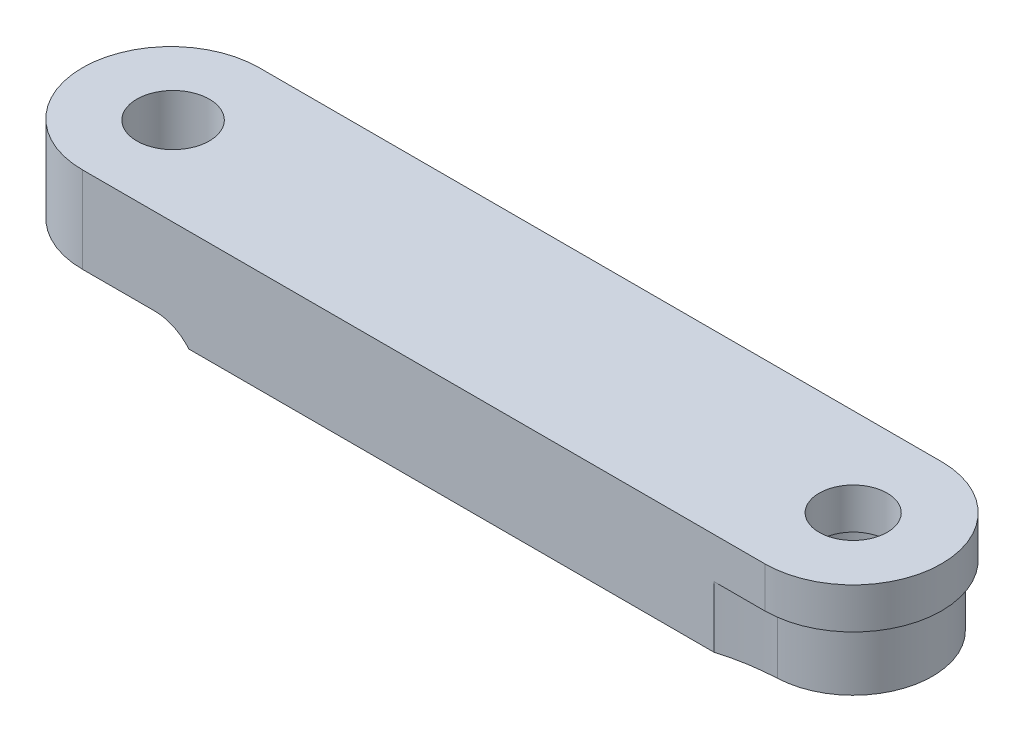
ISO-10303-21;
HEADER;
FILE_DESCRIPTION(('STEP AP214'),'2;1');
FILE_NAME('part.step','',(''),(''),'','','');
FILE_SCHEMA(('AUTOMOTIVE_DESIGN { 1 0 10303 214 1 1 1 1 }'));
ENDSEC;
DATA;
#1=APPLICATION_CONTEXT('core data for automotive mechanical design processes');
#2=APPLICATION_PROTOCOL_DEFINITION('international standard','automotive_design',2000,#1);
#3=PRODUCT_CONTEXT('',#1,'mechanical');
#4=PRODUCT('Part','Part','',(#3));
#5=PRODUCT_RELATED_PRODUCT_CATEGORY('part','',(#4));
#6=PRODUCT_DEFINITION_FORMATION('','',#4);
#7=PRODUCT_DEFINITION_CONTEXT('part definition',#1,'design');
#8=PRODUCT_DEFINITION('design','',#6,#7);
#9=PRODUCT_DEFINITION_SHAPE('','',#8);
#10=(LENGTH_UNIT() NAMED_UNIT(*) SI_UNIT(.MILLI.,.METRE.));
#11=(NAMED_UNIT(*) PLANE_ANGLE_UNIT() SI_UNIT($,.RADIAN.));
#12=(NAMED_UNIT(*) SI_UNIT($,.STERADIAN.) SOLID_ANGLE_UNIT());
#13=UNCERTAINTY_MEASURE_WITH_UNIT(LENGTH_MEASURE(1.E-05),#10,'distance_accuracy_value','');
#14=(GEOMETRIC_REPRESENTATION_CONTEXT(3) GLOBAL_UNCERTAINTY_ASSIGNED_CONTEXT((#13)) GLOBAL_UNIT_ASSIGNED_CONTEXT((#10,
#11,#12)) REPRESENTATION_CONTEXT('',''));
#15=CARTESIAN_POINT('',(0.,0.,0.));
#16=DIRECTION('',(0.,0.,1.));
#17=DIRECTION('',(1.,0.,0.));
#18=AXIS2_PLACEMENT_3D('',#15,#16,#17);
#19=CARTESIAN_POINT('',(0.,0.7,3.9));
#20=DIRECTION('',(0.,1.,0.));
#21=DIRECTION('',(0.,0.,1.));
#22=AXIS2_PLACEMENT_3D('',#19,#20,#21);
#23=PLANE('',#22);
#24=CARTESIAN_POINT('',(-30.,0.7,0.));
#25=DIRECTION('',(0.,1.,0.));
#26=DIRECTION('',(0.,0.,1.));
#27=AXIS2_PLACEMENT_3D('',#24,#25,#26);
#28=CIRCLE('',#27,1.6);
#29=CARTESIAN_POINT('',(-30.,0.7,1.6));
#30=VERTEX_POINT('',#29);
#31=EDGE_CURVE('E168',#30,#30,#28,.T.);
#32=ORIENTED_EDGE('',*,*,#31,.T.);
#33=EDGE_LOOP('',(#32));
#34=FACE_BOUND('',#33,.T.);
#35=DIRECTION('',(1.,0.,0.));
#36=VECTOR('',#35,1.);
#37=CARTESIAN_POINT('',(0.,0.7,-3.9));
#38=LINE('',#37,#36);
#39=CARTESIAN_POINT('',(-30.1,0.7,-3.9));
#40=VERTEX_POINT('',#39);
#41=CARTESIAN_POINT('',(-26.9198684153571,0.7,-3.9));
#42=VERTEX_POINT('',#41);
#43=EDGE_CURVE('E166',#40,#42,#38,.T.);
#44=ORIENTED_EDGE('',*,*,#43,.T.);
#45=DIRECTION('',(0.,0.,-1.));
#46=VECTOR('',#45,1.);
#47=CARTESIAN_POINT('',(-26.9198684153571,0.7,3.9));
#48=LINE('',#47,#46);
#49=CARTESIAN_POINT('',(-26.9198684153571,0.7,3.9));
#50=VERTEX_POINT('',#49);
#51=EDGE_CURVE('E79',#42,#50,#48,.F.);
#52=ORIENTED_EDGE('',*,*,#51,.T.);
#53=DIRECTION('',(1.,0.,0.));
#54=VECTOR('',#53,1.);
#55=CARTESIAN_POINT('',(0.,0.7,3.9));
#56=LINE('',#55,#54);
#57=CARTESIAN_POINT('',(-30.1,0.7,3.9));
#58=VERTEX_POINT('',#57);
#59=EDGE_CURVE('E138',#58,#50,#56,.T.);
#60=ORIENTED_EDGE('',*,*,#59,.F.);
#61=CARTESIAN_POINT('',(-30.1,0.7,0.));
#62=DIRECTION('',(0.,1.,0.));
#63=DIRECTION('',(0.,0.,1.));
#64=AXIS2_PLACEMENT_3D('',#61,#62,#63);
#65=CIRCLE('',#64,3.9);
#66=EDGE_CURVE('E148',#58,#40,#65,.F.);
#67=ORIENTED_EDGE('',*,*,#66,.T.);
#68=EDGE_LOOP('',(#44,#52,#60,#67));
#69=FACE_BOUND('',#68,.T.);
#70=ADVANCED_FACE('F58',(#34,#69),#23,.F.);
#71=CARTESIAN_POINT('',(0.,4.5,3.90000000000001));
#72=DIRECTION('',(0.,0.,-1.));
#73=DIRECTION('',(-1.,0.,0.));
#74=AXIS2_PLACEMENT_3D('',#71,#72,#73);
#75=PLANE('',#74);
#76=DIRECTION('',(0.,-1.,0.));
#77=VECTOR('',#76,1.);
#78=CARTESIAN_POINT('',(-30.1,4.5,3.9));
#79=LINE('',#78,#77);
#80=CARTESIAN_POINT('',(-30.1,4.5,3.9));
#81=VERTEX_POINT('',#80);
#82=EDGE_CURVE('E135',#81,#58,#79,.T.);
#83=ORIENTED_EDGE('',*,*,#82,.T.);
#84=ORIENTED_EDGE('',*,*,#59,.T.);
#85=CARTESIAN_POINT('',(-26.9198684153571,-1.3,3.9));
#86=DIRECTION('',(0.,0.,-1.));
#87=DIRECTION('',(-1.,0.,0.));
#88=AXIS2_PLACEMENT_3D('',#85,#86,#87);
#89=CIRCLE('',#88,2.);
#90=CARTESIAN_POINT('',(-25.4,0.,3.9));
#91=VERTEX_POINT('',#90);
#92=EDGE_CURVE('E12',#50,#91,#89,.T.);
#93=ORIENTED_EDGE('',*,*,#92,.T.);
#94=DIRECTION('',(-1.,0.,0.));
#95=VECTOR('',#94,1.);
#96=CARTESIAN_POINT('',(0.,0.,3.9));
#97=LINE('',#96,#95);
#98=CARTESIAN_POINT('',(-2.25,0.,3.9));
#99=VERTEX_POINT('',#98);
#100=EDGE_CURVE('E153',#99,#91,#97,.T.);
#101=ORIENTED_EDGE('',*,*,#100,.F.);
#102=DIRECTION('',(0.,1.,0.));
#103=VECTOR('',#102,1.);
#104=CARTESIAN_POINT('',(-2.25,0.,3.9));
#105=LINE('',#104,#103);
#106=CARTESIAN_POINT('',(-2.25,2.7,3.90000000000001));
#107=VERTEX_POINT('',#106);
#108=EDGE_CURVE('E157',#99,#107,#105,.T.);
#109=ORIENTED_EDGE('',*,*,#108,.T.);
#110=DIRECTION('',(1.,0.,0.));
#111=VECTOR('',#110,1.);
#112=CARTESIAN_POINT('',(0.,2.7,3.90000000000001));
#113=LINE('',#112,#111);
#114=CARTESIAN_POINT('',(0.,2.7,3.90000000000001));
#115=VERTEX_POINT('',#114);
#116=EDGE_CURVE('E186',#107,#115,#113,.T.);
#117=ORIENTED_EDGE('',*,*,#116,.T.);
#118=DIRECTION('',(0.,-1.,0.));
#119=VECTOR('',#118,1.);
#120=CARTESIAN_POINT('',(0.,4.5,3.90000000000001));
#121=LINE('',#120,#119);
#122=CARTESIAN_POINT('',(0.,4.5,3.90000000000001));
#123=VERTEX_POINT('',#122);
#124=EDGE_CURVE('E145',#123,#115,#121,.T.);
#125=ORIENTED_EDGE('',*,*,#124,.F.);
#126=DIRECTION('',(1.,0.,0.));
#127=VECTOR('',#126,1.);
#128=CARTESIAN_POINT('',(0.,4.5,3.90000000000001));
#129=LINE('',#128,#127);
#130=EDGE_CURVE('E141',#81,#123,#129,.T.);
#131=ORIENTED_EDGE('',*,*,#130,.F.);
#132=EDGE_LOOP('',(#83,#84,#93,#101,#109,#117,#125,#131));
#133=FACE_BOUND('',#132,.T.);
#134=ADVANCED_FACE('F137',(#133),#75,.F.);
#135=CARTESIAN_POINT('',(0.,4.5,-3.9));
#136=DIRECTION('',(0.,0.,1.));
#137=DIRECTION('',(1.,0.,0.));
#138=AXIS2_PLACEMENT_3D('',#135,#136,#137);
#139=PLANE('',#138);
#140=ORIENTED_EDGE('',*,*,#43,.F.);
#141=DIRECTION('',(0.,-1.,0.));
#142=VECTOR('',#141,1.);
#143=CARTESIAN_POINT('',(-30.1,4.5,-3.9));
#144=LINE('',#143,#142);
#145=CARTESIAN_POINT('',(-30.1,4.5,-3.9));
#146=VERTEX_POINT('',#145);
#147=EDGE_CURVE('E144',#146,#40,#144,.T.);
#148=ORIENTED_EDGE('',*,*,#147,.F.);
#149=DIRECTION('',(-1.,0.,0.));
#150=VECTOR('',#149,1.);
#151=CARTESIAN_POINT('',(0.,4.5,-3.9));
#152=LINE('',#151,#150);
#153=CARTESIAN_POINT('',(0.,4.5,-3.9));
#154=VERTEX_POINT('',#153);
#155=EDGE_CURVE('E185',#154,#146,#152,.T.);
#156=ORIENTED_EDGE('',*,*,#155,.F.);
#157=DIRECTION('',(0.,-1.,0.));
#158=VECTOR('',#157,1.);
#159=CARTESIAN_POINT('',(0.,4.5,-3.9));
#160=LINE('',#159,#158);
#161=CARTESIAN_POINT('',(0.,2.7,-3.9));
#162=VERTEX_POINT('',#161);
#163=EDGE_CURVE('E200',#154,#162,#160,.T.);
#164=ORIENTED_EDGE('',*,*,#163,.T.);
#165=DIRECTION('',(-1.,0.,0.));
#166=VECTOR('',#165,1.);
#167=CARTESIAN_POINT('',(0.,2.7,-3.9));
#168=LINE('',#167,#166);
#169=CARTESIAN_POINT('',(-2.25,2.7,-3.9));
#170=VERTEX_POINT('',#169);
#171=EDGE_CURVE('E193',#162,#170,#168,.T.);
#172=ORIENTED_EDGE('',*,*,#171,.T.);
#173=DIRECTION('',(0.,1.,0.));
#174=VECTOR('',#173,1.);
#175=CARTESIAN_POINT('',(-2.25,0.,-3.9));
#176=LINE('',#175,#174);
#177=CARTESIAN_POINT('',(-2.25,0.,-3.9));
#178=VERTEX_POINT('',#177);
#179=EDGE_CURVE('E154',#178,#170,#176,.T.);
#180=ORIENTED_EDGE('',*,*,#179,.F.);
#181=DIRECTION('',(-1.,0.,0.));
#182=VECTOR('',#181,1.);
#183=CARTESIAN_POINT('',(0.,0.,-3.9));
#184=LINE('',#183,#182);
#185=CARTESIAN_POINT('',(-25.4,0.,-3.9));
#186=VERTEX_POINT('',#185);
#187=EDGE_CURVE('E160',#178,#186,#184,.T.);
#188=ORIENTED_EDGE('',*,*,#187,.T.);
#189=CARTESIAN_POINT('',(-26.9198684153571,-1.3,-3.9));
#190=DIRECTION('',(0.,0.,1.));
#191=DIRECTION('',(1.,0.,0.));
#192=AXIS2_PLACEMENT_3D('',#189,#190,#191);
#193=CIRCLE('',#192,2.);
#194=EDGE_CURVE('E66',#186,#42,#193,.T.);
#195=ORIENTED_EDGE('',*,*,#194,.T.);
#196=EDGE_LOOP('',(#140,#148,#156,#164,#172,#180,#188,#195));
#197=FACE_BOUND('',#196,.T.);
#198=ADVANCED_FACE('F251',(#197),#139,.F.);
#199=CARTESIAN_POINT('',(0.,2.7,0.));
#200=DIRECTION('',(0.,-1.,0.));
#201=DIRECTION('',(0.,0.,-1.));
#202=AXIS2_PLACEMENT_3D('',#199,#200,#201);
#203=CYLINDRICAL_SURFACE('',#202,3.5);
#204=CARTESIAN_POINT('',(0.,2.7,0.));
#205=DIRECTION('',(0.,1.,0.));
#206=DIRECTION('',(0.,0.,1.));
#207=AXIS2_PLACEMENT_3D('',#204,#205,#206);
#208=CIRCLE('',#207,3.5);
#209=CARTESIAN_POINT('',(0.154134895235334,2.7,3.49660441486749));
#210=VERTEX_POINT('',#209);
#211=CARTESIAN_POINT('',(0.154134895235327,2.7,-3.49660441486749));
#212=VERTEX_POINT('',#211);
#213=EDGE_CURVE('E210',#210,#212,#208,.T.);
#214=ORIENTED_EDGE('',*,*,#213,.F.);
#215=DIRECTION('',(0.,-1.,0.));
#216=VECTOR('',#215,1.);
#217=CARTESIAN_POINT('',(0.154134895235334,2.7,3.49660441486749));
#218=LINE('',#217,#216);
#219=CARTESIAN_POINT('',(0.154134895235334,0.,3.49660441486749));
#220=VERTEX_POINT('',#219);
#221=EDGE_CURVE('E221',#210,#220,#218,.T.);
#222=ORIENTED_EDGE('',*,*,#221,.T.);
#223=CARTESIAN_POINT('',(0.,0.,0.));
#224=DIRECTION('',(0.,1.,0.));
#225=DIRECTION('',(0.,0.,1.));
#226=AXIS2_PLACEMENT_3D('',#223,#224,#225);
#227=CIRCLE('',#226,3.5);
#228=CARTESIAN_POINT('',(0.154134895235327,0.,-3.49660441486749));
#229=VERTEX_POINT('',#228);
#230=EDGE_CURVE('E209',#220,#229,#227,.T.);
#231=ORIENTED_EDGE('',*,*,#230,.T.);
#232=DIRECTION('',(0.,-1.,0.));
#233=VECTOR('',#232,1.);
#234=CARTESIAN_POINT('',(0.154134895235327,2.7,-3.49660441486749));
#235=LINE('',#234,#233);
#236=EDGE_CURVE('E219',#229,#212,#235,.F.);
#237=ORIENTED_EDGE('',*,*,#236,.T.);
#238=EDGE_LOOP('',(#214,#222,#231,#237));
#239=FACE_BOUND('',#238,.T.);
#240=ADVANCED_FACE('F256',(#239),#203,.T.);
#241=CARTESIAN_POINT('',(0.,2.7,0.));
#242=DIRECTION('',(0.,-1.,0.));
#243=DIRECTION('',(0.,0.,-1.));
#244=AXIS2_PLACEMENT_3D('',#241,#242,#243);
#245=PLANE('',#244);
#246=ORIENTED_EDGE('',*,*,#116,.F.);
#247=CARTESIAN_POINT('',(0.59452031019343,2.7,13.4869027430603));
#248=DIRECTION('',(0.,-1.,0.));
#249=DIRECTION('',(0.,0.,-1.));
#250=AXIS2_PLACEMENT_3D('',#247,#248,#249);
#251=CIRCLE('',#250,10.);
#252=EDGE_CURVE('E217',#107,#210,#251,.T.);
#253=ORIENTED_EDGE('',*,*,#252,.T.);
#254=ORIENTED_EDGE('',*,*,#213,.T.);
#255=CARTESIAN_POINT('',(0.594520310193404,2.7,-13.4869027430603));
#256=DIRECTION('',(0.,-1.,0.));
#257=DIRECTION('',(0.,0.,-1.));
#258=AXIS2_PLACEMENT_3D('',#255,#256,#257);
#259=CIRCLE('',#258,10.);
#260=EDGE_CURVE('E213',#212,#170,#259,.T.);
#261=ORIENTED_EDGE('',*,*,#260,.T.);
#262=ORIENTED_EDGE('',*,*,#171,.F.);
#263=CARTESIAN_POINT('',(0.,2.7,0.));
#264=DIRECTION('',(0.,1.,0.));
#265=DIRECTION('',(0.,0.,-1.));
#266=AXIS2_PLACEMENT_3D('',#263,#264,#265);
#267=CIRCLE('',#266,3.9);
#268=EDGE_CURVE('E181',#115,#162,#267,.T.);
#269=ORIENTED_EDGE('',*,*,#268,.F.);
#270=EDGE_LOOP('',(#246,#253,#254,#261,#262,#269));
#271=FACE_BOUND('',#270,.T.);
#272=ADVANCED_FACE('F259',(#271),#245,.T.);
#273=CARTESIAN_POINT('',(0.,0.,0.));
#274=DIRECTION('',(0.,1.,0.));
#275=DIRECTION('',(0.,0.,1.));
#276=AXIS2_PLACEMENT_3D('',#273,#274,#275);
#277=PLANE('',#276);
#278=CARTESIAN_POINT('',(0.,0.,0.));
#279=DIRECTION('',(0.,1.,0.));
#280=DIRECTION('',(0.,0.,1.));
#281=AXIS2_PLACEMENT_3D('',#278,#279,#280);
#282=CIRCLE('',#281,2.25);
#283=CARTESIAN_POINT('',(0.,0.,-2.25));
#284=VERTEX_POINT('',#283);
#285=EDGE_CURVE('E206',#284,#284,#282,.T.);
#286=ORIENTED_EDGE('',*,*,#285,.T.);
#287=EDGE_LOOP('',(#286));
#288=FACE_BOUND('',#287,.T.);
#289=ORIENTED_EDGE('',*,*,#187,.F.);
#290=CARTESIAN_POINT('',(0.594520310193404,0.,-13.4869027430603));
#291=DIRECTION('',(0.,1.,0.));
#292=DIRECTION('',(0.,0.,1.));
#293=AXIS2_PLACEMENT_3D('',#290,#291,#292);
#294=CIRCLE('',#293,10.);
#295=EDGE_CURVE('E151',#178,#229,#294,.T.);
#296=ORIENTED_EDGE('',*,*,#295,.T.);
#297=ORIENTED_EDGE('',*,*,#230,.F.);
#298=CARTESIAN_POINT('',(0.59452031019343,0.,13.4869027430603));
#299=DIRECTION('',(0.,1.,0.));
#300=DIRECTION('',(0.,0.,1.));
#301=AXIS2_PLACEMENT_3D('',#298,#299,#300);
#302=CIRCLE('',#301,10.);
#303=EDGE_CURVE('E223',#220,#99,#302,.T.);
#304=ORIENTED_EDGE('',*,*,#303,.T.);
#305=ORIENTED_EDGE('',*,*,#100,.T.);
#306=DIRECTION('',(0.,0.,-1.));
#307=VECTOR('',#306,1.);
#308=CARTESIAN_POINT('',(-25.4,0.,3.9));
#309=LINE('',#308,#307);
#310=EDGE_CURVE('E165',#91,#186,#309,.T.);
#311=ORIENTED_EDGE('',*,*,#310,.T.);
#312=EDGE_LOOP('',(#289,#296,#297,#304,#305,#311));
#313=FACE_BOUND('',#312,.T.);
#314=ADVANCED_FACE('F269',(#288,#313),#277,.F.);
#315=CARTESIAN_POINT('',(0.,2.7,0.));
#316=DIRECTION('',(0.,-1.,0.));
#317=DIRECTION('',(0.,0.,-1.));
#318=AXIS2_PLACEMENT_3D('',#315,#316,#317);
#319=CYLINDRICAL_SURFACE('',#318,2.25);
#320=CARTESIAN_POINT('',(0.,2.7,0.));
#321=DIRECTION('',(0.,-1.,0.));
#322=DIRECTION('',(0.,0.,-1.));
#323=AXIS2_PLACEMENT_3D('',#320,#321,#322);
#324=CIRCLE('',#323,2.25);
#325=CARTESIAN_POINT('',(0.,2.7,-2.25));
#326=VERTEX_POINT('',#325);
#327=EDGE_CURVE('E203',#326,#326,#324,.T.);
#328=CARTESIAN_POINT('',(0.,0.,-2.25));
#329=CARTESIAN_POINT('',(0.,0.0281249999999996,-2.25));
#330=CARTESIAN_POINT('',(0.,0.0562499999999997,-2.25));
#331=CARTESIAN_POINT('',(0.,0.1125,-2.25));
#332=CARTESIAN_POINT('',(0.,0.140625,-2.25));
#333=CARTESIAN_POINT('',(0.,0.196875,-2.25));
#334=CARTESIAN_POINT('',(0.,0.225,-2.25));
#335=CARTESIAN_POINT('',(0.,0.28125,-2.25));
#336=CARTESIAN_POINT('',(0.,0.309375,-2.25));
#337=CARTESIAN_POINT('',(0.,0.365625,-2.25));
#338=CARTESIAN_POINT('',(0.,0.39375,-2.25));
#339=CARTESIAN_POINT('',(0.,0.45,-2.25));
#340=CARTESIAN_POINT('',(0.,0.478125,-2.25));
#341=CARTESIAN_POINT('',(0.,0.534375,-2.25));
#342=CARTESIAN_POINT('',(0.,0.5625,-2.25));
#343=CARTESIAN_POINT('',(0.,0.61875,-2.25));
#344=CARTESIAN_POINT('',(0.,0.646875,-2.25));
#345=CARTESIAN_POINT('',(0.,0.703125,-2.25));
#346=CARTESIAN_POINT('',(0.,0.73125,-2.25));
#347=CARTESIAN_POINT('',(0.,0.7875,-2.25));
#348=CARTESIAN_POINT('',(0.,0.815625,-2.25));
#349=CARTESIAN_POINT('',(0.,0.871875,-2.25));
#350=CARTESIAN_POINT('',(0.,0.9,-2.25));
#351=CARTESIAN_POINT('',(0.,0.95625,-2.25));
#352=CARTESIAN_POINT('',(0.,0.984375,-2.25));
#353=CARTESIAN_POINT('',(0.,1.040625,-2.25));
#354=CARTESIAN_POINT('',(0.,1.06875,-2.25));
#355=CARTESIAN_POINT('',(0.,1.125,-2.25));
#356=CARTESIAN_POINT('',(0.,1.153125,-2.25));
#357=CARTESIAN_POINT('',(0.,1.209375,-2.25));
#358=CARTESIAN_POINT('',(0.,1.2375,-2.25));
#359=CARTESIAN_POINT('',(0.,1.29375,-2.25));
#360=CARTESIAN_POINT('',(0.,1.321875,-2.25));
#361=CARTESIAN_POINT('',(0.,1.378125,-2.25));
#362=CARTESIAN_POINT('',(0.,1.40625,-2.25));
#363=CARTESIAN_POINT('',(0.,1.4625,-2.25));
#364=CARTESIAN_POINT('',(0.,1.490625,-2.25));
#365=CARTESIAN_POINT('',(0.,1.546875,-2.25));
#366=CARTESIAN_POINT('',(0.,1.575,-2.25));
#367=CARTESIAN_POINT('',(0.,1.63125,-2.25));
#368=CARTESIAN_POINT('',(0.,1.659375,-2.25));
#369=CARTESIAN_POINT('',(0.,1.715625,-2.25));
#370=CARTESIAN_POINT('',(0.,1.74375,-2.25));
#371=CARTESIAN_POINT('',(0.,1.8,-2.25));
#372=CARTESIAN_POINT('',(0.,1.828125,-2.25));
#373=CARTESIAN_POINT('',(0.,1.884375,-2.25));
#374=CARTESIAN_POINT('',(0.,1.9125,-2.25));
#375=CARTESIAN_POINT('',(0.,1.96875,-2.25));
#376=CARTESIAN_POINT('',(0.,1.996875,-2.25));
#377=CARTESIAN_POINT('',(0.,2.053125,-2.25));
#378=CARTESIAN_POINT('',(0.,2.08125,-2.25));
#379=CARTESIAN_POINT('',(0.,2.1375,-2.25));
#380=CARTESIAN_POINT('',(0.,2.165625,-2.25));
#381=CARTESIAN_POINT('',(0.,2.221875,-2.25));
#382=CARTESIAN_POINT('',(0.,2.25,-2.25));
#383=CARTESIAN_POINT('',(0.,2.30625,-2.25));
#384=CARTESIAN_POINT('',(0.,2.334375,-2.25));
#385=CARTESIAN_POINT('',(0.,2.390625,-2.25));
#386=CARTESIAN_POINT('',(0.,2.41875,-2.25));
#387=CARTESIAN_POINT('',(0.,2.475,-2.25));
#388=CARTESIAN_POINT('',(0.,2.503125,-2.25));
#389=CARTESIAN_POINT('',(0.,2.559375,-2.25));
#390=CARTESIAN_POINT('',(0.,2.5875,-2.25));
#391=CARTESIAN_POINT('',(0.,2.64375,-2.25));
#392=CARTESIAN_POINT('',(0.,2.671875,-2.25));
#393=CARTESIAN_POINT('',(0.,2.7,-2.25));
#394=B_SPLINE_CURVE_WITH_KNOTS('',3,(#328,#329,#330,#331,#332,#333,#334,#335,#336,#337,#338,
#339,#340,#341,#342,#343,#344,#345,#346,#347,#348,#349,#350,#351,#352,#353,#354,#355,#356,#357,
#358,#359,#360,#361,#362,#363,#364,#365,#366,#367,#368,#369,#370,#371,#372,#373,#374,#375,#376,
#377,#378,#379,#380,#381,#382,#383,#384,#385,#386,#387,#388,#389,#390,#391,#392,#393),
.UNSPECIFIED.,.F.,.F.,(4,2,2,2,2,2,2,2,2,2,2,2,2,2,2,2,2,2,2,2,2,2,2,2,2,2,2,2,2,2,2,2,4),(0.,
0.0843750000000003,0.16875,0.253125,0.3375,0.421875,0.50625,0.590625,0.675,0.759375,0.84375,
0.928125,1.0125,1.096875,1.18125,1.265625,1.35,1.434375,1.51875,1.603125,1.6875,1.771875,
1.85625,1.940625,2.025,2.109375,2.19375,2.278125,2.3625,2.446875,2.53125,2.615625,2.7),.UNSPECIFIED.);
#395=EDGE_CURVE('BSEAM265',#284,#326,#394,.T.);
#396=ORIENTED_EDGE('',*,*,#285,.F.);
#397=ORIENTED_EDGE('',*,*,#327,.F.);
#398=ORIENTED_EDGE('',*,*,#395,.T.);
#399=ORIENTED_EDGE('',*,*,#395,.F.);
#400=EDGE_LOOP('',(#396,#398,#397,#399));
#401=FACE_BOUND('',#400,.T.);
#402=ADVANCED_FACE('F265',(#401),#319,.F.);
#403=CARTESIAN_POINT('',(0.,2.7,0.));
#404=DIRECTION('',(0.,1.,0.));
#405=DIRECTION('',(0.,0.,1.));
#406=AXIS2_PLACEMENT_3D('',#403,#404,#405);
#407=CIRCLE('',#406,1.5);
#408=CARTESIAN_POINT('',(0.,2.7,1.5));
#409=VERTEX_POINT('',#408);
#410=EDGE_CURVE('E172',#409,#409,#407,.T.);
#411=ORIENTED_EDGE('',*,*,#410,.T.);
#412=EDGE_LOOP('',(#411));
#413=FACE_BOUND('',#412,.T.);
#414=ORIENTED_EDGE('',*,*,#327,.T.);
#415=EDGE_LOOP('',(#414));
#416=FACE_BOUND('',#415,.T.);
#417=ADVANCED_FACE('F268',(#413,#416),#245,.T.);
#418=CARTESIAN_POINT('',(0.,4.5,0.));
#419=DIRECTION('',(0.,-1.,0.));
#420=DIRECTION('',(0.,0.,-1.));
#421=AXIS2_PLACEMENT_3D('',#418,#419,#420);
#422=PLANE('',#421);
#423=CARTESIAN_POINT('',(0.,4.5,0.));
#424=DIRECTION('',(0.,1.,0.));
#425=DIRECTION('',(0.,0.,-1.));
#426=AXIS2_PLACEMENT_3D('',#423,#424,#425);
#427=CIRCLE('',#426,3.9);
#428=EDGE_CURVE('E182',#123,#154,#427,.T.);
#429=ORIENTED_EDGE('',*,*,#428,.T.);
#430=ORIENTED_EDGE('',*,*,#155,.T.);
#431=CARTESIAN_POINT('',(-30.1,4.5,0.));
#432=DIRECTION('',(0.,1.,0.));
#433=DIRECTION('',(0.,0.,1.));
#434=AXIS2_PLACEMENT_3D('',#431,#432,#433);
#435=CIRCLE('',#434,3.9);
#436=EDGE_CURVE('E188',#146,#81,#435,.T.);
#437=ORIENTED_EDGE('',*,*,#436,.T.);
#438=ORIENTED_EDGE('',*,*,#130,.T.);
#439=EDGE_LOOP('',(#429,#430,#437,#438));
#440=FACE_BOUND('',#439,.T.);
#441=CARTESIAN_POINT('',(-30.,4.5,0.));
#442=DIRECTION('',(0.,1.,0.));
#443=DIRECTION('',(0.,0.,1.));
#444=AXIS2_PLACEMENT_3D('',#441,#442,#443);
#445=CIRCLE('',#444,1.6);
#446=CARTESIAN_POINT('',(-30.,4.5,1.6));
#447=VERTEX_POINT('',#446);
#448=EDGE_CURVE('E176',#447,#447,#445,.T.);
#449=ORIENTED_EDGE('',*,*,#448,.F.);
#450=EDGE_LOOP('',(#449));
#451=FACE_BOUND('',#450,.T.);
#452=CARTESIAN_POINT('',(0.,4.5,0.));
#453=DIRECTION('',(0.,1.,0.));
#454=DIRECTION('',(0.,0.,1.));
#455=AXIS2_PLACEMENT_3D('',#452,#453,#454);
#456=CIRCLE('',#455,1.5);
#457=CARTESIAN_POINT('',(0.,4.5,1.5));
#458=VERTEX_POINT('',#457);
#459=EDGE_CURVE('E173',#458,#458,#456,.T.);
#460=ORIENTED_EDGE('',*,*,#459,.F.);
#461=EDGE_LOOP('',(#460));
#462=FACE_BOUND('',#461,.T.);
#463=ADVANCED_FACE('F263',(#440,#451,#462),#422,.F.);
#464=CARTESIAN_POINT('',(0.,4.5,0.));
#465=DIRECTION('',(0.,-1.,0.));
#466=DIRECTION('',(0.,0.,-1.));
#467=AXIS2_PLACEMENT_3D('',#464,#465,#466);
#468=CYLINDRICAL_SURFACE('',#467,3.9);
#469=ORIENTED_EDGE('',*,*,#268,.T.);
#470=ORIENTED_EDGE('',*,*,#163,.F.);
#471=ORIENTED_EDGE('',*,*,#428,.F.);
#472=ORIENTED_EDGE('',*,*,#124,.T.);
#473=EDGE_LOOP('',(#469,#470,#471,#472));
#474=FACE_BOUND('',#473,.T.);
#475=ADVANCED_FACE('F243',(#474),#468,.T.);
#476=CARTESIAN_POINT('',(-30.1,4.5,0.));
#477=DIRECTION('',(0.,-1.,0.));
#478=DIRECTION('',(0.,0.,-1.));
#479=AXIS2_PLACEMENT_3D('',#476,#477,#478);
#480=CYLINDRICAL_SURFACE('',#479,3.9);
#481=ORIENTED_EDGE('',*,*,#66,.F.);
#482=ORIENTED_EDGE('',*,*,#82,.F.);
#483=ORIENTED_EDGE('',*,*,#436,.F.);
#484=ORIENTED_EDGE('',*,*,#147,.T.);
#485=EDGE_LOOP('',(#481,#482,#483,#484));
#486=FACE_BOUND('',#485,.T.);
#487=ADVANCED_FACE('F149',(#486),#480,.T.);
#488=CARTESIAN_POINT('',(-30.,4.5,0.));
#489=DIRECTION('',(0.,-1.,0.));
#490=DIRECTION('',(0.,0.,-1.));
#491=AXIS2_PLACEMENT_3D('',#488,#489,#490);
#492=CYLINDRICAL_SURFACE('',#491,1.6);
#493=ORIENTED_EDGE('',*,*,#448,.T.);
#494=EDGE_LOOP('',(#493));
#495=FACE_BOUND('',#494,.T.);
#496=ORIENTED_EDGE('',*,*,#31,.F.);
#497=EDGE_LOOP('',(#496));
#498=FACE_BOUND('',#497,.T.);
#499=ADVANCED_FACE('F231',(#495,#498),#492,.F.);
#500=CARTESIAN_POINT('',(0.,4.5,0.));
#501=DIRECTION('',(0.,-1.,0.));
#502=DIRECTION('',(0.,0.,-1.));
#503=AXIS2_PLACEMENT_3D('',#500,#501,#502);
#504=CYLINDRICAL_SURFACE('',#503,1.5);
#505=ORIENTED_EDGE('',*,*,#459,.T.);
#506=EDGE_LOOP('',(#505));
#507=FACE_BOUND('',#506,.T.);
#508=ORIENTED_EDGE('',*,*,#410,.F.);
#509=EDGE_LOOP('',(#508));
#510=FACE_BOUND('',#509,.T.);
#511=ADVANCED_FACE('F233',(#507,#510),#504,.F.);
#512=CARTESIAN_POINT('',(0.59452031019343,2.7,13.4869027430603));
#513=DIRECTION('',(0.,-1.,0.));
#514=DIRECTION('',(1.,0.,0.));
#515=AXIS2_PLACEMENT_3D('',#512,#513,#514);
#516=CYLINDRICAL_SURFACE('',#515,10.);
#517=ORIENTED_EDGE('',*,*,#303,.F.);
#518=ORIENTED_EDGE('',*,*,#221,.F.);
#519=ORIENTED_EDGE('',*,*,#252,.F.);
#520=ORIENTED_EDGE('',*,*,#108,.F.);
#521=EDGE_LOOP('',(#517,#518,#519,#520));
#522=FACE_BOUND('',#521,.T.);
#523=ADVANCED_FACE('F240',(#522),#516,.F.);
#524=CARTESIAN_POINT('',(0.594520310193404,2.7,-13.4869027430603));
#525=DIRECTION('',(0.,1.,0.));
#526=DIRECTION('',(-1.,0.,0.));
#527=AXIS2_PLACEMENT_3D('',#524,#525,#526);
#528=CYLINDRICAL_SURFACE('',#527,10.);
#529=ORIENTED_EDGE('',*,*,#260,.F.);
#530=ORIENTED_EDGE('',*,*,#236,.F.);
#531=ORIENTED_EDGE('',*,*,#295,.F.);
#532=ORIENTED_EDGE('',*,*,#179,.T.);
#533=EDGE_LOOP('',(#529,#530,#531,#532));
#534=FACE_BOUND('',#533,.T.);
#535=ADVANCED_FACE('F278',(#534),#528,.F.);
#536=CARTESIAN_POINT('',(-26.9198684153571,-1.3,3.9));
#537=DIRECTION('',(0.,0.,-1.));
#538=DIRECTION('',(-1.,0.,0.));
#539=AXIS2_PLACEMENT_3D('',#536,#537,#538);
#540=CYLINDRICAL_SURFACE('',#539,2.);
#541=ORIENTED_EDGE('',*,*,#92,.F.);
#542=ORIENTED_EDGE('',*,*,#51,.F.);
#543=ORIENTED_EDGE('',*,*,#194,.F.);
#544=ORIENTED_EDGE('',*,*,#310,.F.);
#545=EDGE_LOOP('',(#541,#542,#543,#544));
#546=FACE_BOUND('',#545,.T.);
#547=ADVANCED_FACE('F60',(#546),#540,.F.);
#548=CLOSED_SHELL('',(#70,#134,#198,#240,#272,#314,#402,#417,#463,#475,#487,#499,#511,#523,#535,#547));
#549=MANIFOLD_SOLID_BREP('B2',#548);
#550=ADVANCED_BREP_SHAPE_REPRESENTATION('',(#18,#549),#14);
#551=SHAPE_DEFINITION_REPRESENTATION(#9,#550);
ENDSEC;
END-ISO-10303-21;
